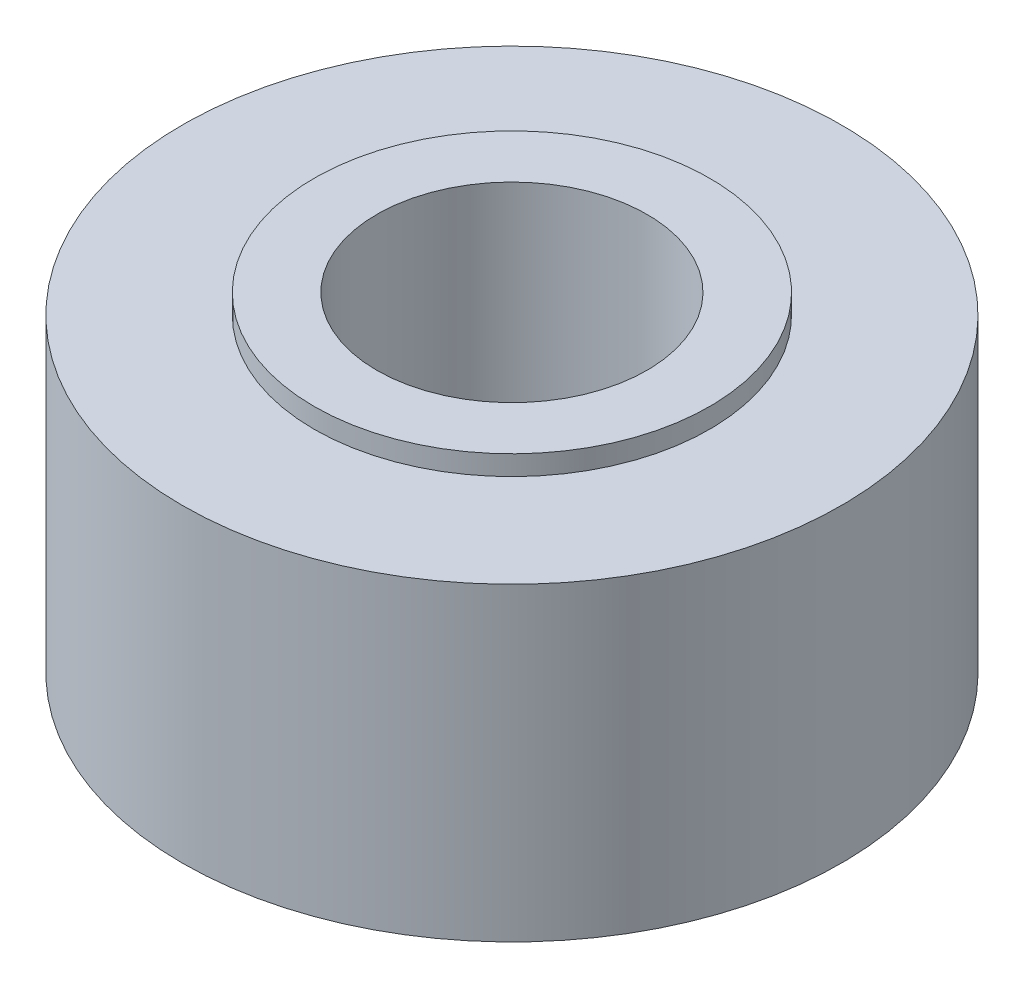
ISO-10303-21;
HEADER;
FILE_DESCRIPTION(('STEP AP214'),'2;1');
FILE_NAME('part.step','',(''),(''),'','','');
FILE_SCHEMA(('AUTOMOTIVE_DESIGN { 1 0 10303 214 1 1 1 1 }'));
ENDSEC;
DATA;
#1=APPLICATION_CONTEXT('core data for automotive mechanical design processes');
#2=APPLICATION_PROTOCOL_DEFINITION('international standard','automotive_design',2000,#1);
#3=PRODUCT_CONTEXT('',#1,'mechanical');
#4=PRODUCT('Part','Part','',(#3));
#5=PRODUCT_RELATED_PRODUCT_CATEGORY('part','',(#4));
#6=PRODUCT_DEFINITION_FORMATION('','',#4);
#7=PRODUCT_DEFINITION_CONTEXT('part definition',#1,'design');
#8=PRODUCT_DEFINITION('design','',#6,#7);
#9=PRODUCT_DEFINITION_SHAPE('','',#8);
#10=(LENGTH_UNIT() NAMED_UNIT(*) SI_UNIT(.MILLI.,.METRE.));
#11=(NAMED_UNIT(*) PLANE_ANGLE_UNIT() SI_UNIT($,.RADIAN.));
#12=(NAMED_UNIT(*) SI_UNIT($,.STERADIAN.) SOLID_ANGLE_UNIT());
#13=UNCERTAINTY_MEASURE_WITH_UNIT(LENGTH_MEASURE(1.E-05),#10,'distance_accuracy_value','');
#14=(GEOMETRIC_REPRESENTATION_CONTEXT(3) GLOBAL_UNCERTAINTY_ASSIGNED_CONTEXT((#13)) GLOBAL_UNIT_ASSIGNED_CONTEXT((#10,
#11,#12)) REPRESENTATION_CONTEXT('',''));
#15=CARTESIAN_POINT('',(0.,0.,0.));
#16=DIRECTION('',(0.,0.,1.));
#17=DIRECTION('',(1.,0.,0.));
#18=AXIS2_PLACEMENT_3D('',#15,#16,#17);
#19=CARTESIAN_POINT('',(0.,4.7,0.));
#20=DIRECTION('',(0.,1.,0.));
#21=DIRECTION('',(0.,0.,1.));
#22=AXIS2_PLACEMENT_3D('',#19,#20,#21);
#23=PLANE('',#22);
#24=CARTESIAN_POINT('',(0.,4.7,0.));
#25=DIRECTION('',(0.,1.,0.));
#26=DIRECTION('',(0.,0.,1.));
#27=AXIS2_PLACEMENT_3D('',#24,#25,#26);
#28=CIRCLE('',#27,5.);
#29=CARTESIAN_POINT('',(0.,4.7,5.));
#30=VERTEX_POINT('',#29);
#31=EDGE_CURVE('E10',#30,#30,#28,.T.);
#32=ORIENTED_EDGE('',*,*,#31,.T.);
#33=EDGE_LOOP('',(#32));
#34=FACE_BOUND('',#33,.T.);
#35=CARTESIAN_POINT('',(0.,4.7,0.));
#36=DIRECTION('',(0.,1.,0.));
#37=DIRECTION('',(0.,0.,1.));
#38=AXIS2_PLACEMENT_3D('',#35,#36,#37);
#39=CIRCLE('',#38,3.);
#40=CARTESIAN_POINT('',(0.,4.7,3.));
#41=VERTEX_POINT('',#40);
#42=EDGE_CURVE('E44',#41,#41,#39,.T.);
#43=ORIENTED_EDGE('',*,*,#42,.F.);
#44=EDGE_LOOP('',(#43));
#45=FACE_BOUND('',#44,.T.);
#46=ADVANCED_FACE('F31',(#34,#45),#23,.T.);
#47=CARTESIAN_POINT('',(0.,4.7,0.));
#48=DIRECTION('',(0.,-1.,0.));
#49=DIRECTION('',(0.,0.,-1.));
#50=AXIS2_PLACEMENT_3D('',#47,#48,#49);
#51=CYLINDRICAL_SURFACE('',#50,5.);
#52=ORIENTED_EDGE('',*,*,#31,.F.);
#53=EDGE_LOOP('',(#52));
#54=FACE_BOUND('',#53,.T.);
#55=CARTESIAN_POINT('',(0.,0.,0.));
#56=DIRECTION('',(0.,1.,0.));
#57=DIRECTION('',(0.,0.,1.));
#58=AXIS2_PLACEMENT_3D('',#55,#56,#57);
#59=CIRCLE('',#58,5.);
#60=CARTESIAN_POINT('',(0.,0.,5.));
#61=VERTEX_POINT('',#60);
#62=EDGE_CURVE('E35',#61,#61,#59,.T.);
#63=ORIENTED_EDGE('',*,*,#62,.T.);
#64=EDGE_LOOP('',(#63));
#65=FACE_BOUND('',#64,.T.);
#66=ADVANCED_FACE('F33',(#54,#65),#51,.T.);
#67=CARTESIAN_POINT('',(0.,0.,0.));
#68=DIRECTION('',(0.,1.,0.));
#69=DIRECTION('',(0.,0.,1.));
#70=AXIS2_PLACEMENT_3D('',#67,#68,#69);
#71=PLANE('',#70);
#72=CARTESIAN_POINT('',(0.,0.,0.));
#73=DIRECTION('',(0.,1.,0.));
#74=DIRECTION('',(0.,0.,1.));
#75=AXIS2_PLACEMENT_3D('',#72,#73,#74);
#76=CIRCLE('',#75,2.05);
#77=CARTESIAN_POINT('',(0.,0.,2.05));
#78=VERTEX_POINT('',#77);
#79=EDGE_CURVE('E47',#78,#78,#76,.T.);
#80=ORIENTED_EDGE('',*,*,#79,.T.);
#81=EDGE_LOOP('',(#80));
#82=FACE_BOUND('',#81,.T.);
#83=ORIENTED_EDGE('',*,*,#62,.F.);
#84=EDGE_LOOP('',(#83));
#85=FACE_BOUND('',#84,.T.);
#86=ADVANCED_FACE('F56',(#82,#85),#71,.F.);
#87=CARTESIAN_POINT('',(0.,5.,0.));
#88=DIRECTION('',(0.,-1.,0.));
#89=DIRECTION('',(0.,0.,-1.));
#90=AXIS2_PLACEMENT_3D('',#87,#88,#89);
#91=CYLINDRICAL_SURFACE('',#90,3.);
#92=CARTESIAN_POINT('',(0.,5.,0.));
#93=DIRECTION('',(0.,1.,0.));
#94=DIRECTION('',(0.,0.,1.));
#95=AXIS2_PLACEMENT_3D('',#92,#93,#94);
#96=CIRCLE('',#95,3.);
#97=CARTESIAN_POINT('',(0.,5.,3.));
#98=VERTEX_POINT('',#97);
#99=EDGE_CURVE('E42',#98,#98,#96,.T.);
#100=ORIENTED_EDGE('',*,*,#99,.F.);
#101=EDGE_LOOP('',(#100));
#102=FACE_BOUND('',#101,.T.);
#103=ORIENTED_EDGE('',*,*,#42,.T.);
#104=EDGE_LOOP('',(#103));
#105=FACE_BOUND('',#104,.T.);
#106=ADVANCED_FACE('F68',(#102,#105),#91,.T.);
#107=CARTESIAN_POINT('',(0.,5.,0.));
#108=DIRECTION('',(0.,1.,0.));
#109=DIRECTION('',(0.,0.,1.));
#110=AXIS2_PLACEMENT_3D('',#107,#108,#109);
#111=PLANE('',#110);
#112=CARTESIAN_POINT('',(0.,5.,0.));
#113=DIRECTION('',(0.,1.,0.));
#114=DIRECTION('',(0.,0.,1.));
#115=AXIS2_PLACEMENT_3D('',#112,#113,#114);
#116=CIRCLE('',#115,2.05);
#117=CARTESIAN_POINT('',(0.,5.,2.05));
#118=VERTEX_POINT('',#117);
#119=EDGE_CURVE('E50',#118,#118,#116,.T.);
#120=ORIENTED_EDGE('',*,*,#119,.F.);
#121=EDGE_LOOP('',(#120));
#122=FACE_BOUND('',#121,.T.);
#123=ORIENTED_EDGE('',*,*,#99,.T.);
#124=EDGE_LOOP('',(#123));
#125=FACE_BOUND('',#124,.T.);
#126=ADVANCED_FACE('F62',(#122,#125),#111,.T.);
#127=CARTESIAN_POINT('',(0.,0.,0.));
#128=DIRECTION('',(0.,1.,0.));
#129=DIRECTION('',(0.,0.,1.));
#130=AXIS2_PLACEMENT_3D('',#127,#128,#129);
#131=CYLINDRICAL_SURFACE('',#130,2.05);
#132=ORIENTED_EDGE('',*,*,#79,.F.);
#133=EDGE_LOOP('',(#132));
#134=FACE_BOUND('',#133,.T.);
#135=ORIENTED_EDGE('',*,*,#119,.T.);
#136=EDGE_LOOP('',(#135));
#137=FACE_BOUND('',#136,.T.);
#138=ADVANCED_FACE('F59',(#134,#137),#131,.F.);
#139=CLOSED_SHELL('',(#46,#66,#86,#106,#126,#138));
#140=MANIFOLD_SOLID_BREP('B2',#139);
#141=ADVANCED_BREP_SHAPE_REPRESENTATION('',(#18,#140),#14);
#142=SHAPE_DEFINITION_REPRESENTATION(#9,#141);
ENDSEC;
END-ISO-10303-21;
